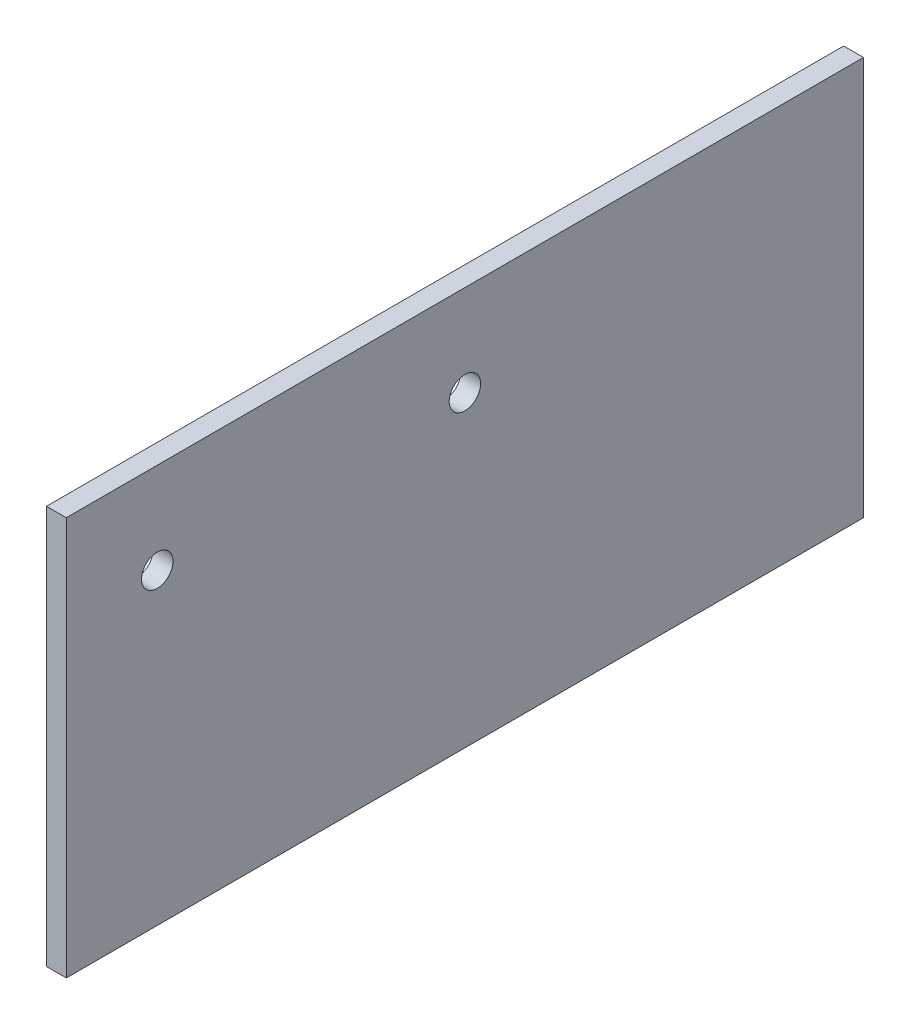
ISO-10303-21;
HEADER;
FILE_DESCRIPTION(('STEP AP214'),'2;1');
FILE_NAME('part.step','',(''),(''),'','','');
FILE_SCHEMA(('AUTOMOTIVE_DESIGN { 1 0 10303 214 1 1 1 1 }'));
ENDSEC;
DATA;
#1=APPLICATION_CONTEXT('core data for automotive mechanical design processes');
#2=APPLICATION_PROTOCOL_DEFINITION('international standard','automotive_design',2000,#1);
#3=PRODUCT_CONTEXT('',#1,'mechanical');
#4=PRODUCT('Part','Part','',(#3));
#5=PRODUCT_RELATED_PRODUCT_CATEGORY('part','',(#4));
#6=PRODUCT_DEFINITION_FORMATION('','',#4);
#7=PRODUCT_DEFINITION_CONTEXT('part definition',#1,'design');
#8=PRODUCT_DEFINITION('design','',#6,#7);
#9=PRODUCT_DEFINITION_SHAPE('','',#8);
#10=(LENGTH_UNIT() NAMED_UNIT(*) SI_UNIT(.MILLI.,.METRE.));
#11=(NAMED_UNIT(*) PLANE_ANGLE_UNIT() SI_UNIT($,.RADIAN.));
#12=(NAMED_UNIT(*) SI_UNIT($,.STERADIAN.) SOLID_ANGLE_UNIT());
#13=UNCERTAINTY_MEASURE_WITH_UNIT(LENGTH_MEASURE(1.E-05),#10,'distance_accuracy_value','');
#14=(GEOMETRIC_REPRESENTATION_CONTEXT(3) GLOBAL_UNCERTAINTY_ASSIGNED_CONTEXT((#13)) GLOBAL_UNIT_ASSIGNED_CONTEXT((#10,
#11,#12)) REPRESENTATION_CONTEXT('',''));
#15=CARTESIAN_POINT('',(0.,0.,0.));
#16=DIRECTION('',(0.,0.,1.));
#17=DIRECTION('',(1.,0.,0.));
#18=AXIS2_PLACEMENT_3D('',#15,#16,#17);
#19=CARTESIAN_POINT('',(2.25,90.5,-90.5));
#20=DIRECTION('',(0.,0.,1.));
#21=DIRECTION('',(1.,0.,0.));
#22=AXIS2_PLACEMENT_3D('',#19,#20,#21);
#23=PLANE('',#22);
#24=DIRECTION('',(0.,1.,0.));
#25=VECTOR('',#24,1.);
#26=CARTESIAN_POINT('',(-2.25,90.5,-90.5));
#27=LINE('',#26,#25);
#28=CARTESIAN_POINT('',(-2.25,0.,-90.5));
#29=VERTEX_POINT('',#28);
#30=CARTESIAN_POINT('',(-2.25,90.5,-90.5));
#31=VERTEX_POINT('',#30);
#32=EDGE_CURVE('E95',#29,#31,#27,.T.);
#33=ORIENTED_EDGE('',*,*,#32,.T.);
#34=DIRECTION('',(-1.,0.,0.));
#35=VECTOR('',#34,1.);
#36=CARTESIAN_POINT('',(2.25,90.5,-90.5));
#37=LINE('',#36,#35);
#38=CARTESIAN_POINT('',(2.25,90.5,-90.5));
#39=VERTEX_POINT('',#38);
#40=EDGE_CURVE('E11',#39,#31,#37,.T.);
#41=ORIENTED_EDGE('',*,*,#40,.F.);
#42=DIRECTION('',(0.,1.,0.));
#43=VECTOR('',#42,1.);
#44=CARTESIAN_POINT('',(2.25,90.5,-90.5));
#45=LINE('',#44,#43);
#46=CARTESIAN_POINT('',(2.25,0.,-90.5));
#47=VERTEX_POINT('',#46);
#48=EDGE_CURVE('E83',#47,#39,#45,.T.);
#49=ORIENTED_EDGE('',*,*,#48,.F.);
#50=DIRECTION('',(-1.,0.,0.));
#51=VECTOR('',#50,1.);
#52=CARTESIAN_POINT('',(2.25,0.,-90.5));
#53=LINE('',#52,#51);
#54=EDGE_CURVE('E91',#47,#29,#53,.T.);
#55=ORIENTED_EDGE('',*,*,#54,.T.);
#56=EDGE_LOOP('',(#33,#41,#49,#55));
#57=FACE_BOUND('',#56,.T.);
#58=ADVANCED_FACE('F32',(#57),#23,.F.);
#59=CARTESIAN_POINT('',(2.25,90.5,90.5));
#60=DIRECTION('',(0.,-1.,0.));
#61=DIRECTION('',(0.,0.,-1.));
#62=AXIS2_PLACEMENT_3D('',#59,#60,#61);
#63=PLANE('',#62);
#64=DIRECTION('',(0.,0.,1.));
#65=VECTOR('',#64,1.);
#66=CARTESIAN_POINT('',(-2.25,90.5,90.5));
#67=LINE('',#66,#65);
#68=CARTESIAN_POINT('',(-2.25,90.5,90.5));
#69=VERTEX_POINT('',#68);
#70=EDGE_CURVE('E87',#31,#69,#67,.T.);
#71=ORIENTED_EDGE('',*,*,#70,.T.);
#72=DIRECTION('',(-1.,0.,0.));
#73=VECTOR('',#72,1.);
#74=CARTESIAN_POINT('',(2.25,90.5,90.5));
#75=LINE('',#74,#73);
#76=CARTESIAN_POINT('',(2.25,90.5,90.5));
#77=VERTEX_POINT('',#76);
#78=EDGE_CURVE('E40',#77,#69,#75,.T.);
#79=ORIENTED_EDGE('',*,*,#78,.F.);
#80=DIRECTION('',(0.,0.,1.));
#81=VECTOR('',#80,1.);
#82=CARTESIAN_POINT('',(2.25,90.5,90.5));
#83=LINE('',#82,#81);
#84=EDGE_CURVE('E78',#39,#77,#83,.T.);
#85=ORIENTED_EDGE('',*,*,#84,.F.);
#86=ORIENTED_EDGE('',*,*,#40,.T.);
#87=EDGE_LOOP('',(#71,#79,#85,#86));
#88=FACE_BOUND('',#87,.T.);
#89=ADVANCED_FACE('F86',(#88),#63,.F.);
#90=CARTESIAN_POINT('',(2.25,90.5,90.5));
#91=DIRECTION('',(0.,0.,-1.));
#92=DIRECTION('',(-1.,0.,0.));
#93=AXIS2_PLACEMENT_3D('',#90,#91,#92);
#94=PLANE('',#93);
#95=DIRECTION('',(0.,-1.,0.));
#96=VECTOR('',#95,1.);
#97=CARTESIAN_POINT('',(-2.25,90.5,90.5));
#98=LINE('',#97,#96);
#99=CARTESIAN_POINT('',(-2.25,0.,90.5));
#100=VERTEX_POINT('',#99);
#101=EDGE_CURVE('E65',#69,#100,#98,.T.);
#102=ORIENTED_EDGE('',*,*,#101,.T.);
#103=DIRECTION('',(-1.,0.,0.));
#104=VECTOR('',#103,1.);
#105=CARTESIAN_POINT('',(2.25,0.,90.5));
#106=LINE('',#105,#104);
#107=CARTESIAN_POINT('',(2.25,0.,90.5));
#108=VERTEX_POINT('',#107);
#109=EDGE_CURVE('E88',#108,#100,#106,.T.);
#110=ORIENTED_EDGE('',*,*,#109,.F.);
#111=DIRECTION('',(0.,-1.,0.));
#112=VECTOR('',#111,1.);
#113=CARTESIAN_POINT('',(2.25,90.5,90.5));
#114=LINE('',#113,#112);
#115=EDGE_CURVE('E81',#77,#108,#114,.T.);
#116=ORIENTED_EDGE('',*,*,#115,.F.);
#117=ORIENTED_EDGE('',*,*,#78,.T.);
#118=EDGE_LOOP('',(#102,#110,#116,#117));
#119=FACE_BOUND('',#118,.T.);
#120=ADVANCED_FACE('F89',(#119),#94,.F.);
#121=CARTESIAN_POINT('',(2.25,0.,90.5));
#122=DIRECTION('',(0.,1.,0.));
#123=DIRECTION('',(0.,0.,1.));
#124=AXIS2_PLACEMENT_3D('',#121,#122,#123);
#125=PLANE('',#124);
#126=DIRECTION('',(0.,0.,-1.));
#127=VECTOR('',#126,1.);
#128=CARTESIAN_POINT('',(-2.25,0.,90.5));
#129=LINE('',#128,#127);
#130=EDGE_CURVE('E71',#100,#29,#129,.T.);
#131=ORIENTED_EDGE('',*,*,#130,.T.);
#132=ORIENTED_EDGE('',*,*,#54,.F.);
#133=DIRECTION('',(0.,0.,-1.));
#134=VECTOR('',#133,1.);
#135=CARTESIAN_POINT('',(2.25,0.,90.5));
#136=LINE('',#135,#134);
#137=EDGE_CURVE('E48',#108,#47,#136,.T.);
#138=ORIENTED_EDGE('',*,*,#137,.F.);
#139=ORIENTED_EDGE('',*,*,#109,.T.);
#140=EDGE_LOOP('',(#131,#132,#138,#139));
#141=FACE_BOUND('',#140,.T.);
#142=ADVANCED_FACE('F103',(#141),#125,.F.);
#143=CARTESIAN_POINT('',(2.25,0.,0.));
#144=DIRECTION('',(1.,0.,0.));
#145=DIRECTION('',(0.,0.,-1.));
#146=AXIS2_PLACEMENT_3D('',#143,#144,#145);
#147=PLANE('',#146);
#148=CARTESIAN_POINT('',(2.25,69.85,0.));
#149=DIRECTION('',(1.,0.,0.));
#150=DIRECTION('',(0.,0.,-1.));
#151=AXIS2_PLACEMENT_3D('',#148,#149,#150);
#152=CIRCLE('',#151,3.56870000000001);
#153=CARTESIAN_POINT('',(2.25,69.85,-3.56870000000001));
#154=VERTEX_POINT('',#153);
#155=EDGE_CURVE('E114',#154,#154,#152,.T.);
#156=ORIENTED_EDGE('',*,*,#155,.F.);
#157=EDGE_LOOP('',(#156));
#158=FACE_BOUND('',#157,.T.);
#159=CARTESIAN_POINT('',(2.25,69.85,69.85));
#160=DIRECTION('',(1.,0.,0.));
#161=DIRECTION('',(0.,0.,-1.));
#162=AXIS2_PLACEMENT_3D('',#159,#160,#161);
#163=CIRCLE('',#162,3.56870000000001);
#164=CARTESIAN_POINT('',(2.25,69.85,66.2813));
#165=VERTEX_POINT('',#164);
#166=EDGE_CURVE('E98',#165,#165,#163,.T.);
#167=ORIENTED_EDGE('',*,*,#166,.F.);
#168=EDGE_LOOP('',(#167));
#169=FACE_BOUND('',#168,.T.);
#170=ORIENTED_EDGE('',*,*,#48,.T.);
#171=ORIENTED_EDGE('',*,*,#84,.T.);
#172=ORIENTED_EDGE('',*,*,#115,.T.);
#173=ORIENTED_EDGE('',*,*,#137,.T.);
#174=EDGE_LOOP('',(#170,#171,#172,#173));
#175=FACE_BOUND('',#174,.T.);
#176=ADVANCED_FACE('F79',(#158,#169,#175),#147,.T.);
#177=CARTESIAN_POINT('',(-2.25,0.,0.));
#178=DIRECTION('',(1.,0.,0.));
#179=DIRECTION('',(0.,0.,-1.));
#180=AXIS2_PLACEMENT_3D('',#177,#178,#179);
#181=PLANE('',#180);
#182=CARTESIAN_POINT('',(-2.25,69.85,0.));
#183=DIRECTION('',(1.,0.,0.));
#184=DIRECTION('',(0.,0.,-1.));
#185=AXIS2_PLACEMENT_3D('',#182,#183,#184);
#186=CIRCLE('',#185,3.56870000000001);
#187=CARTESIAN_POINT('',(-2.25,69.85,-3.56870000000001));
#188=VERTEX_POINT('',#187);
#189=EDGE_CURVE('E117',#188,#188,#186,.T.);
#190=ORIENTED_EDGE('',*,*,#189,.T.);
#191=EDGE_LOOP('',(#190));
#192=FACE_BOUND('',#191,.T.);
#193=CARTESIAN_POINT('',(-2.25,69.85,69.85));
#194=DIRECTION('',(1.,0.,0.));
#195=DIRECTION('',(0.,0.,-1.));
#196=AXIS2_PLACEMENT_3D('',#193,#194,#195);
#197=CIRCLE('',#196,3.56870000000001);
#198=CARTESIAN_POINT('',(-2.25,69.85,66.2813));
#199=VERTEX_POINT('',#198);
#200=EDGE_CURVE('E111',#199,#199,#197,.T.);
#201=ORIENTED_EDGE('',*,*,#200,.T.);
#202=EDGE_LOOP('',(#201));
#203=FACE_BOUND('',#202,.T.);
#204=ORIENTED_EDGE('',*,*,#32,.F.);
#205=ORIENTED_EDGE('',*,*,#130,.F.);
#206=ORIENTED_EDGE('',*,*,#101,.F.);
#207=ORIENTED_EDGE('',*,*,#70,.F.);
#208=EDGE_LOOP('',(#204,#205,#206,#207));
#209=FACE_BOUND('',#208,.T.);
#210=ADVANCED_FACE('F106',(#192,#203,#209),#181,.F.);
#211=CARTESIAN_POINT('',(-2.25,69.85,69.85));
#212=DIRECTION('',(1.,0.,0.));
#213=DIRECTION('',(0.,0.,-1.));
#214=AXIS2_PLACEMENT_3D('',#211,#212,#213);
#215=CYLINDRICAL_SURFACE('',#214,3.56870000000001);
#216=ORIENTED_EDGE('',*,*,#166,.T.);
#217=EDGE_LOOP('',(#216));
#218=FACE_BOUND('',#217,.T.);
#219=ORIENTED_EDGE('',*,*,#200,.F.);
#220=EDGE_LOOP('',(#219));
#221=FACE_BOUND('',#220,.T.);
#222=ADVANCED_FACE('F125',(#218,#221),#215,.F.);
#223=CARTESIAN_POINT('',(-2.25,69.85,0.));
#224=DIRECTION('',(1.,0.,0.));
#225=DIRECTION('',(0.,0.,-1.));
#226=AXIS2_PLACEMENT_3D('',#223,#224,#225);
#227=CYLINDRICAL_SURFACE('',#226,3.56870000000001);
#228=ORIENTED_EDGE('',*,*,#155,.T.);
#229=EDGE_LOOP('',(#228));
#230=FACE_BOUND('',#229,.T.);
#231=ORIENTED_EDGE('',*,*,#189,.F.);
#232=EDGE_LOOP('',(#231));
#233=FACE_BOUND('',#232,.T.);
#234=ADVANCED_FACE('F123',(#230,#233),#227,.F.);
#235=CLOSED_SHELL('',(#58,#89,#120,#142,#176,#210,#222,#234));
#236=MANIFOLD_SOLID_BREP('B2',#235);
#237=ADVANCED_BREP_SHAPE_REPRESENTATION('',(#18,#236),#14);
#238=SHAPE_DEFINITION_REPRESENTATION(#9,#237);
ENDSEC;
END-ISO-10303-21;
